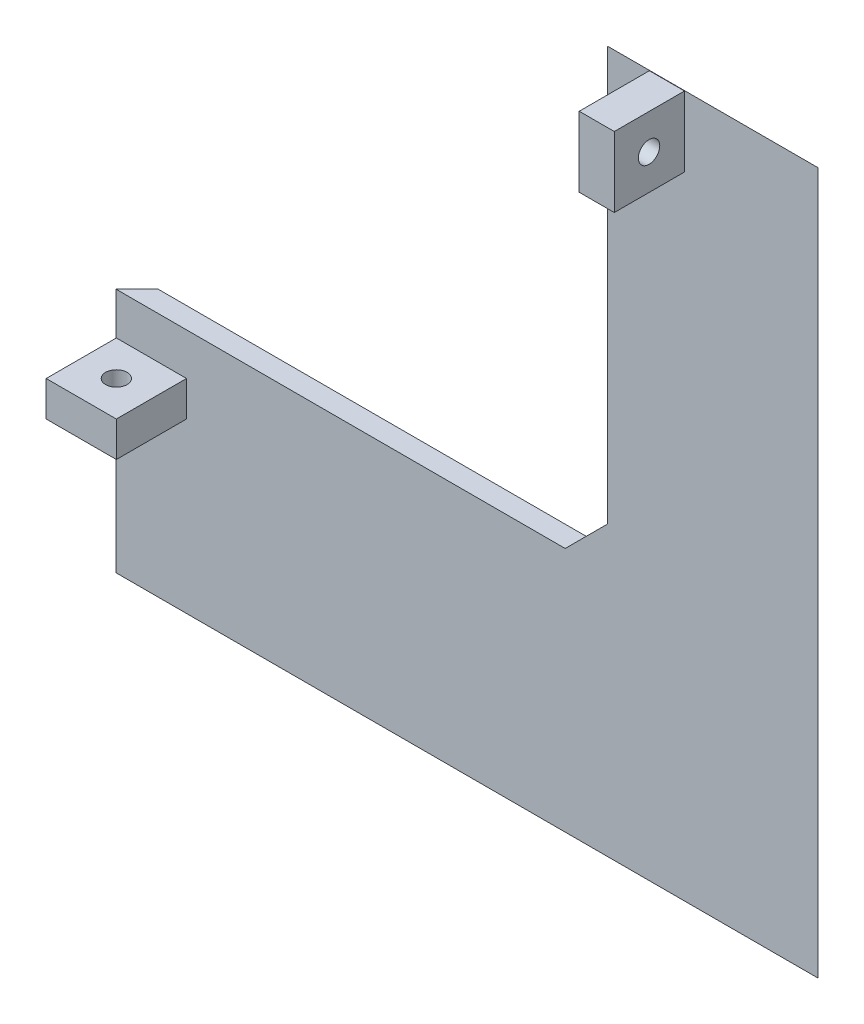
ISO-10303-21;
HEADER;
FILE_DESCRIPTION(('STEP AP214'),'2;1');
FILE_NAME('part.step','',(''),(''),'','','');
FILE_SCHEMA(('AUTOMOTIVE_DESIGN { 1 0 10303 214 1 1 1 1 }'));
ENDSEC;
DATA;
#1=APPLICATION_CONTEXT('core data for automotive mechanical design processes');
#2=APPLICATION_PROTOCOL_DEFINITION('international standard','automotive_design',2000,#1);
#3=PRODUCT_CONTEXT('',#1,'mechanical');
#4=PRODUCT('Part','Part','',(#3));
#5=PRODUCT_RELATED_PRODUCT_CATEGORY('part','',(#4));
#6=PRODUCT_DEFINITION_FORMATION('','',#4);
#7=PRODUCT_DEFINITION_CONTEXT('part definition',#1,'design');
#8=PRODUCT_DEFINITION('design','',#6,#7);
#9=PRODUCT_DEFINITION_SHAPE('','',#8);
#10=(LENGTH_UNIT() NAMED_UNIT(*) SI_UNIT(.MILLI.,.METRE.));
#11=(NAMED_UNIT(*) PLANE_ANGLE_UNIT() SI_UNIT($,.RADIAN.));
#12=(NAMED_UNIT(*) SI_UNIT($,.STERADIAN.) SOLID_ANGLE_UNIT());
#13=UNCERTAINTY_MEASURE_WITH_UNIT(LENGTH_MEASURE(1.E-05),#10,'distance_accuracy_value','');
#14=(GEOMETRIC_REPRESENTATION_CONTEXT(3) GLOBAL_UNCERTAINTY_ASSIGNED_CONTEXT((#13)) GLOBAL_UNIT_ASSIGNED_CONTEXT((#10,
#11,#12)) REPRESENTATION_CONTEXT('',''));
#15=CARTESIAN_POINT('',(0.,0.,0.));
#16=DIRECTION('',(0.,0.,1.));
#17=DIRECTION('',(1.,0.,0.));
#18=AXIS2_PLACEMENT_3D('',#15,#16,#17);
#19=CARTESIAN_POINT('',(0.,0.,3.));
#20=DIRECTION('',(0.,0.,1.));
#21=DIRECTION('',(1.,0.,0.));
#22=AXIS2_PLACEMENT_3D('',#19,#20,#21);
#23=PLANE('',#22);
#24=DIRECTION('',(0.,1.,0.));
#25=VECTOR('',#24,1.);
#26=CARTESIAN_POINT('',(70.,35.,3.));
#27=LINE('',#26,#25);
#28=CARTESIAN_POINT('',(70.,41.,3.));
#29=VERTEX_POINT('',#28);
#30=CARTESIAN_POINT('',(70.,100.,3.));
#31=VERTEX_POINT('',#30);
#32=EDGE_CURVE('E152',#29,#31,#27,.T.);
#33=ORIENTED_EDGE('',*,*,#32,.F.);
#34=DIRECTION('',(0.707106781186545,0.70710678118655,0.));
#35=VECTOR('',#34,1.);
#36=CARTESIAN_POINT('',(70.,41.,3.));
#37=LINE('',#36,#35);
#38=CARTESIAN_POINT('',(64.,35.,3.));
#39=VERTEX_POINT('',#38);
#40=EDGE_CURVE('E41',#29,#39,#37,.F.);
#41=ORIENTED_EDGE('',*,*,#40,.T.);
#42=DIRECTION('',(1.,0.,0.));
#43=VECTOR('',#42,1.);
#44=CARTESIAN_POINT('',(0.,35.,3.));
#45=LINE('',#44,#43);
#46=CARTESIAN_POINT('',(0.,35.,3.));
#47=VERTEX_POINT('',#46);
#48=EDGE_CURVE('E139',#47,#39,#45,.T.);
#49=ORIENTED_EDGE('',*,*,#48,.F.);
#50=DIRECTION('',(0.,-1.,0.));
#51=VECTOR('',#50,1.);
#52=CARTESIAN_POINT('',(0.,100.,3.));
#53=LINE('',#52,#51);
#54=CARTESIAN_POINT('',(0.,0.,3.));
#55=VERTEX_POINT('',#54);
#56=EDGE_CURVE('E150',#47,#55,#53,.T.);
#57=ORIENTED_EDGE('',*,*,#56,.T.);
#58=DIRECTION('',(1.,0.,0.));
#59=VECTOR('',#58,1.);
#60=CARTESIAN_POINT('',(0.,0.,3.));
#61=LINE('',#60,#59);
#62=CARTESIAN_POINT('',(100.,0.,3.));
#63=VERTEX_POINT('',#62);
#64=EDGE_CURVE('E157',#55,#63,#61,.T.);
#65=ORIENTED_EDGE('',*,*,#64,.T.);
#66=DIRECTION('',(0.,1.,0.));
#67=VECTOR('',#66,1.);
#68=CARTESIAN_POINT('',(100.,100.,3.));
#69=LINE('',#68,#67);
#70=CARTESIAN_POINT('',(100.,100.,3.));
#71=VERTEX_POINT('',#70);
#72=EDGE_CURVE('E160',#63,#71,#69,.T.);
#73=ORIENTED_EDGE('',*,*,#72,.T.);
#74=DIRECTION('',(-1.,0.,0.));
#75=VECTOR('',#74,1.);
#76=CARTESIAN_POINT('',(0.,100.,3.));
#77=LINE('',#76,#75);
#78=EDGE_CURVE('E169',#71,#31,#77,.T.);
#79=ORIENTED_EDGE('',*,*,#78,.T.);
#80=EDGE_LOOP('',(#33,#41,#49,#57,#65,#73,#79));
#81=FACE_BOUND('',#80,.T.);
#82=DIRECTION('',(-1.,0.,0.));
#83=VECTOR('',#82,1.);
#84=CARTESIAN_POINT('',(81.,99.95,3.));
#85=LINE('',#84,#83);
#86=CARTESIAN_POINT('',(81.,99.95,3.));
#87=VERTEX_POINT('',#86);
#88=CARTESIAN_POINT('',(76.,99.95,3.));
#89=VERTEX_POINT('',#88);
#90=EDGE_CURVE('E256',#87,#89,#85,.T.);
#91=ORIENTED_EDGE('',*,*,#90,.F.);
#92=DIRECTION('',(0.,1.,0.));
#93=VECTOR('',#92,1.);
#94=CARTESIAN_POINT('',(81.,99.95,3.));
#95=LINE('',#94,#93);
#96=CARTESIAN_POINT('',(81.,89.95,3.));
#97=VERTEX_POINT('',#96);
#98=EDGE_CURVE('E242',#97,#87,#95,.T.);
#99=ORIENTED_EDGE('',*,*,#98,.F.);
#100=DIRECTION('',(1.,0.,0.));
#101=VECTOR('',#100,1.);
#102=CARTESIAN_POINT('',(81.,89.95,3.));
#103=LINE('',#102,#101);
#104=CARTESIAN_POINT('',(76.,89.95,3.));
#105=VERTEX_POINT('',#104);
#106=EDGE_CURVE('E247',#105,#97,#103,.T.);
#107=ORIENTED_EDGE('',*,*,#106,.F.);
#108=DIRECTION('',(0.,-1.,0.));
#109=VECTOR('',#108,1.);
#110=CARTESIAN_POINT('',(76.,99.95,3.));
#111=LINE('',#110,#109);
#112=EDGE_CURVE('E258',#89,#105,#111,.T.);
#113=ORIENTED_EDGE('',*,*,#112,.F.);
#114=EDGE_LOOP('',(#91,#99,#107,#113));
#115=FACE_BOUND('',#114,.T.);
#116=DIRECTION('',(-1.,0.,0.));
#117=VECTOR('',#116,1.);
#118=CARTESIAN_POINT('',(10.05,29.,3.));
#119=LINE('',#118,#117);
#120=CARTESIAN_POINT('',(10.05,29.,3.));
#121=VERTEX_POINT('',#120);
#122=CARTESIAN_POINT('',(0.0499999999999789,29.,3.));
#123=VERTEX_POINT('',#122);
#124=EDGE_CURVE('E227',#121,#123,#119,.T.);
#125=ORIENTED_EDGE('',*,*,#124,.F.);
#126=DIRECTION('',(0.,1.,0.));
#127=VECTOR('',#126,1.);
#128=CARTESIAN_POINT('',(10.05,24.,3.));
#129=LINE('',#128,#127);
#130=CARTESIAN_POINT('',(10.05,24.,3.));
#131=VERTEX_POINT('',#130);
#132=EDGE_CURVE('E186',#131,#121,#129,.T.);
#133=ORIENTED_EDGE('',*,*,#132,.F.);
#134=DIRECTION('',(1.,0.,0.));
#135=VECTOR('',#134,1.);
#136=CARTESIAN_POINT('',(10.05,24.,3.));
#137=LINE('',#136,#135);
#138=CARTESIAN_POINT('',(0.0499999999999876,24.,3.));
#139=VERTEX_POINT('',#138);
#140=EDGE_CURVE('E218',#139,#131,#137,.T.);
#141=ORIENTED_EDGE('',*,*,#140,.F.);
#142=DIRECTION('',(0.,-1.,0.));
#143=VECTOR('',#142,1.);
#144=CARTESIAN_POINT('',(0.0499999999999876,24.,3.));
#145=LINE('',#144,#143);
#146=EDGE_CURVE('E229',#123,#139,#145,.T.);
#147=ORIENTED_EDGE('',*,*,#146,.F.);
#148=EDGE_LOOP('',(#125,#133,#141,#147));
#149=FACE_BOUND('',#148,.T.);
#150=ADVANCED_FACE('F33',(#81,#115,#149),#23,.T.);
#151=CARTESIAN_POINT('',(0.,0.,0.));
#152=DIRECTION('',(0.,0.,1.));
#153=DIRECTION('',(1.,0.,0.));
#154=AXIS2_PLACEMENT_3D('',#151,#152,#153);
#155=PLANE('',#154);
#156=DIRECTION('',(1.,0.,0.));
#157=VECTOR('',#156,1.);
#158=CARTESIAN_POINT('',(0.,35.,0.));
#159=LINE('',#158,#157);
#160=CARTESIAN_POINT('',(3.00000000000001,35.,0.));
#161=VERTEX_POINT('',#160);
#162=CARTESIAN_POINT('',(64.,35.,0.));
#163=VERTEX_POINT('',#162);
#164=EDGE_CURVE('E140',#161,#163,#159,.T.);
#165=ORIENTED_EDGE('',*,*,#164,.T.);
#166=DIRECTION('',(-0.707106781186545,-0.70710678118655,0.));
#167=VECTOR('',#166,1.);
#168=CARTESIAN_POINT('',(14.5000000000002,-14.5000000000001,0.));
#169=LINE('',#168,#167);
#170=CARTESIAN_POINT('',(70.,41.,0.));
#171=VERTEX_POINT('',#170);
#172=EDGE_CURVE('E11',#163,#171,#169,.F.);
#173=ORIENTED_EDGE('',*,*,#172,.T.);
#174=DIRECTION('',(0.,1.,0.));
#175=VECTOR('',#174,1.);
#176=CARTESIAN_POINT('',(70.,0.,0.));
#177=LINE('',#176,#175);
#178=CARTESIAN_POINT('',(70.,97.,0.));
#179=VERTEX_POINT('',#178);
#180=EDGE_CURVE('E202',#171,#179,#177,.T.);
#181=ORIENTED_EDGE('',*,*,#180,.T.);
#182=DIRECTION('',(1.,0.,0.));
#183=VECTOR('',#182,1.);
#184=CARTESIAN_POINT('',(0.,97.,0.));
#185=LINE('',#184,#183);
#186=CARTESIAN_POINT('',(97.,97.,0.));
#187=VERTEX_POINT('',#186);
#188=EDGE_CURVE('E174',#179,#187,#185,.T.);
#189=ORIENTED_EDGE('',*,*,#188,.T.);
#190=DIRECTION('',(0.,-1.,0.));
#191=VECTOR('',#190,1.);
#192=CARTESIAN_POINT('',(97.,0.,0.));
#193=LINE('',#192,#191);
#194=CARTESIAN_POINT('',(97.,3.00000000000002,0.));
#195=VERTEX_POINT('',#194);
#196=EDGE_CURVE('E176',#187,#195,#193,.T.);
#197=ORIENTED_EDGE('',*,*,#196,.T.);
#198=DIRECTION('',(-1.,0.,0.));
#199=VECTOR('',#198,1.);
#200=CARTESIAN_POINT('',(0.,3.00000000000002,0.));
#201=LINE('',#200,#199);
#202=CARTESIAN_POINT('',(3.00000000000002,3.00000000000002,0.));
#203=VERTEX_POINT('',#202);
#204=EDGE_CURVE('E146',#195,#203,#201,.T.);
#205=ORIENTED_EDGE('',*,*,#204,.T.);
#206=DIRECTION('',(0.,1.,0.));
#207=VECTOR('',#206,1.);
#208=CARTESIAN_POINT('',(3.00000000000002,0.,0.));
#209=LINE('',#208,#207);
#210=EDGE_CURVE('E172',#203,#161,#209,.T.);
#211=ORIENTED_EDGE('',*,*,#210,.T.);
#212=EDGE_LOOP('',(#165,#173,#181,#189,#197,#205,#211));
#213=FACE_BOUND('',#212,.T.);
#214=ADVANCED_FACE('F301',(#213),#155,.F.);
#215=CARTESIAN_POINT('',(0.,100.,3.00000000000002));
#216=DIRECTION('',(0.,-0.707106781186548,0.707106781186548));
#217=DIRECTION('',(-1.,0.,0.));
#218=AXIS2_PLACEMENT_3D('',#215,#216,#217);
#219=PLANE('',#218);
#220=DIRECTION('',(0.,0.707106781186548,0.707106781186548));
#221=VECTOR('',#220,1.);
#222=CARTESIAN_POINT('',(70.,100.,3.00000000000002));
#223=LINE('',#222,#221);
#224=EDGE_CURVE('E145',#31,#179,#223,.F.);
#225=ORIENTED_EDGE('',*,*,#224,.F.);
#226=ORIENTED_EDGE('',*,*,#78,.F.);
#227=DIRECTION('',(-0.577350269189626,-0.577350269189626,-0.577350269189626));
#228=VECTOR('',#227,1.);
#229=CARTESIAN_POINT('',(66.6666666666667,66.6666666666667,-30.3333333333333));
#230=LINE('',#229,#228);
#231=EDGE_CURVE('E158',#187,#71,#230,.F.);
#232=ORIENTED_EDGE('',*,*,#231,.F.);
#233=ORIENTED_EDGE('',*,*,#188,.F.);
#234=EDGE_LOOP('',(#225,#226,#232,#233));
#235=FACE_BOUND('',#234,.T.);
#236=ADVANCED_FACE('F307',(#235),#219,.F.);
#237=CARTESIAN_POINT('',(0.,100.,3.00000000000002));
#238=DIRECTION('',(0.707106781186548,0.,0.707106781186548));
#239=DIRECTION('',(0.,-1.,0.));
#240=AXIS2_PLACEMENT_3D('',#237,#238,#239);
#241=PLANE('',#240);
#242=DIRECTION('',(0.707106781186548,0.,-0.707106781186548));
#243=VECTOR('',#242,1.);
#244=CARTESIAN_POINT('',(0.,35.,3.00000000000002));
#245=LINE('',#244,#243);
#246=EDGE_CURVE('E137',#161,#47,#245,.F.);
#247=ORIENTED_EDGE('',*,*,#246,.F.);
#248=ORIENTED_EDGE('',*,*,#210,.F.);
#249=DIRECTION('',(-0.577350269189626,-0.577350269189626,0.577350269189626));
#250=VECTOR('',#249,1.);
#251=CARTESIAN_POINT('',(33.3333333333333,33.3333333333333,-30.3333333333333));
#252=LINE('',#251,#250);
#253=EDGE_CURVE('E155',#55,#203,#252,.F.);
#254=ORIENTED_EDGE('',*,*,#253,.F.);
#255=ORIENTED_EDGE('',*,*,#56,.F.);
#256=EDGE_LOOP('',(#247,#248,#254,#255));
#257=FACE_BOUND('',#256,.T.);
#258=ADVANCED_FACE('F154',(#257),#241,.F.);
#259=CARTESIAN_POINT('',(100.,100.,3.00000000000002));
#260=DIRECTION('',(-0.707106781186548,0.,0.707106781186548));
#261=DIRECTION('',(0.,1.,0.));
#262=AXIS2_PLACEMENT_3D('',#259,#260,#261);
#263=PLANE('',#262);
#264=ORIENTED_EDGE('',*,*,#231,.T.);
#265=ORIENTED_EDGE('',*,*,#72,.F.);
#266=DIRECTION('',(-0.577350269189626,0.577350269189626,-0.577350269189626));
#267=VECTOR('',#266,1.);
#268=CARTESIAN_POINT('',(66.6666666666667,33.3333333333333,-30.3333333333333));
#269=LINE('',#268,#267);
#270=EDGE_CURVE('E180',#195,#63,#269,.F.);
#271=ORIENTED_EDGE('',*,*,#270,.F.);
#272=ORIENTED_EDGE('',*,*,#196,.F.);
#273=EDGE_LOOP('',(#264,#265,#271,#272));
#274=FACE_BOUND('',#273,.T.);
#275=ADVANCED_FACE('F316',(#274),#263,.F.);
#276=CARTESIAN_POINT('',(0.,0.,3.00000000000002));
#277=DIRECTION('',(0.,0.707106781186548,0.707106781186548));
#278=DIRECTION('',(1.,0.,0.));
#279=AXIS2_PLACEMENT_3D('',#276,#277,#278);
#280=PLANE('',#279);
#281=ORIENTED_EDGE('',*,*,#253,.T.);
#282=ORIENTED_EDGE('',*,*,#204,.F.);
#283=ORIENTED_EDGE('',*,*,#270,.T.);
#284=ORIENTED_EDGE('',*,*,#64,.F.);
#285=EDGE_LOOP('',(#281,#282,#283,#284));
#286=FACE_BOUND('',#285,.T.);
#287=ADVANCED_FACE('F313',(#286),#280,.F.);
#288=CARTESIAN_POINT('',(81.,99.95,13.));
#289=DIRECTION('',(-1.,0.,0.));
#290=DIRECTION('',(0.,0.,1.));
#291=AXIS2_PLACEMENT_3D('',#288,#289,#290);
#292=PLANE('',#291);
#293=CARTESIAN_POINT('',(81.,94.95,8.05));
#294=DIRECTION('',(1.,0.,0.));
#295=DIRECTION('',(0.,0.,-1.));
#296=AXIS2_PLACEMENT_3D('',#293,#294,#295);
#297=CIRCLE('',#296,1.525);
#298=CARTESIAN_POINT('',(81.,94.95,6.525));
#299=VERTEX_POINT('',#298);
#300=EDGE_CURVE('E187',#299,#299,#297,.T.);
#301=ORIENTED_EDGE('',*,*,#300,.F.);
#302=EDGE_LOOP('',(#301));
#303=FACE_BOUND('',#302,.T.);
#304=ORIENTED_EDGE('',*,*,#98,.T.);
#305=DIRECTION('',(0.,0.,-1.));
#306=VECTOR('',#305,1.);
#307=CARTESIAN_POINT('',(81.,99.95,13.));
#308=LINE('',#307,#306);
#309=CARTESIAN_POINT('',(81.,99.95,13.));
#310=VERTEX_POINT('',#309);
#311=EDGE_CURVE('E165',#310,#87,#308,.T.);
#312=ORIENTED_EDGE('',*,*,#311,.F.);
#313=DIRECTION('',(0.,1.,0.));
#314=VECTOR('',#313,1.);
#315=CARTESIAN_POINT('',(81.,99.95,13.));
#316=LINE('',#315,#314);
#317=CARTESIAN_POINT('',(81.,89.95,13.));
#318=VERTEX_POINT('',#317);
#319=EDGE_CURVE('E243',#318,#310,#316,.T.);
#320=ORIENTED_EDGE('',*,*,#319,.F.);
#321=DIRECTION('',(0.,0.,-1.));
#322=VECTOR('',#321,1.);
#323=CARTESIAN_POINT('',(81.,89.95,13.));
#324=LINE('',#323,#322);
#325=EDGE_CURVE('E253',#318,#97,#324,.T.);
#326=ORIENTED_EDGE('',*,*,#325,.T.);
#327=EDGE_LOOP('',(#304,#312,#320,#326));
#328=FACE_BOUND('',#327,.T.);
#329=ADVANCED_FACE('F278',(#303,#328),#292,.F.);
#330=CARTESIAN_POINT('',(81.,99.95,13.));
#331=DIRECTION('',(0.,-1.,0.));
#332=DIRECTION('',(0.,0.,-1.));
#333=AXIS2_PLACEMENT_3D('',#330,#331,#332);
#334=PLANE('',#333);
#335=ORIENTED_EDGE('',*,*,#90,.T.);
#336=DIRECTION('',(0.,0.,-1.));
#337=VECTOR('',#336,1.);
#338=CARTESIAN_POINT('',(76.,99.95,13.));
#339=LINE('',#338,#337);
#340=CARTESIAN_POINT('',(76.,99.95,13.));
#341=VERTEX_POINT('',#340);
#342=EDGE_CURVE('E265',#341,#89,#339,.T.);
#343=ORIENTED_EDGE('',*,*,#342,.F.);
#344=DIRECTION('',(-1.,0.,0.));
#345=VECTOR('',#344,1.);
#346=CARTESIAN_POINT('',(81.,99.95,13.));
#347=LINE('',#346,#345);
#348=EDGE_CURVE('E246',#310,#341,#347,.T.);
#349=ORIENTED_EDGE('',*,*,#348,.F.);
#350=ORIENTED_EDGE('',*,*,#311,.T.);
#351=EDGE_LOOP('',(#335,#343,#349,#350));
#352=FACE_BOUND('',#351,.T.);
#353=ADVANCED_FACE('F273',(#352),#334,.F.);
#354=CARTESIAN_POINT('',(76.,99.95,13.));
#355=DIRECTION('',(1.,0.,0.));
#356=DIRECTION('',(0.,0.,-1.));
#357=AXIS2_PLACEMENT_3D('',#354,#355,#356);
#358=PLANE('',#357);
#359=CARTESIAN_POINT('',(76.,94.95,8.05));
#360=DIRECTION('',(1.,0.,0.));
#361=DIRECTION('',(0.,0.,-1.));
#362=AXIS2_PLACEMENT_3D('',#359,#360,#361);
#363=CIRCLE('',#362,1.525);
#364=CARTESIAN_POINT('',(76.,94.95,6.525));
#365=VERTEX_POINT('',#364);
#366=EDGE_CURVE('E183',#365,#365,#363,.T.);
#367=ORIENTED_EDGE('',*,*,#366,.T.);
#368=EDGE_LOOP('',(#367));
#369=FACE_BOUND('',#368,.T.);
#370=ORIENTED_EDGE('',*,*,#112,.T.);
#371=DIRECTION('',(0.,0.,-1.));
#372=VECTOR('',#371,1.);
#373=CARTESIAN_POINT('',(76.,89.95,13.));
#374=LINE('',#373,#372);
#375=CARTESIAN_POINT('',(76.,89.95,13.));
#376=VERTEX_POINT('',#375);
#377=EDGE_CURVE('E264',#376,#105,#374,.T.);
#378=ORIENTED_EDGE('',*,*,#377,.F.);
#379=DIRECTION('',(0.,-1.,0.));
#380=VECTOR('',#379,1.);
#381=CARTESIAN_POINT('',(76.,99.95,13.));
#382=LINE('',#381,#380);
#383=EDGE_CURVE('E249',#341,#376,#382,.T.);
#384=ORIENTED_EDGE('',*,*,#383,.F.);
#385=ORIENTED_EDGE('',*,*,#342,.T.);
#386=EDGE_LOOP('',(#370,#378,#384,#385));
#387=FACE_BOUND('',#386,.T.);
#388=ADVANCED_FACE('F283',(#369,#387),#358,.F.);
#389=CARTESIAN_POINT('',(81.,89.95,13.));
#390=DIRECTION('',(0.,1.,0.));
#391=DIRECTION('',(0.,0.,1.));
#392=AXIS2_PLACEMENT_3D('',#389,#390,#391);
#393=PLANE('',#392);
#394=ORIENTED_EDGE('',*,*,#106,.T.);
#395=ORIENTED_EDGE('',*,*,#325,.F.);
#396=DIRECTION('',(1.,0.,0.));
#397=VECTOR('',#396,1.);
#398=CARTESIAN_POINT('',(81.,89.95,13.));
#399=LINE('',#398,#397);
#400=EDGE_CURVE('E251',#376,#318,#399,.T.);
#401=ORIENTED_EDGE('',*,*,#400,.F.);
#402=ORIENTED_EDGE('',*,*,#377,.T.);
#403=EDGE_LOOP('',(#394,#395,#401,#402));
#404=FACE_BOUND('',#403,.T.);
#405=ADVANCED_FACE('F286',(#404),#393,.F.);
#406=CARTESIAN_POINT('',(0.,0.,13.));
#407=DIRECTION('',(0.,0.,-1.));
#408=DIRECTION('',(-1.,0.,0.));
#409=AXIS2_PLACEMENT_3D('',#406,#407,#408);
#410=PLANE('',#409);
#411=ORIENTED_EDGE('',*,*,#319,.T.);
#412=ORIENTED_EDGE('',*,*,#348,.T.);
#413=ORIENTED_EDGE('',*,*,#383,.T.);
#414=ORIENTED_EDGE('',*,*,#400,.T.);
#415=EDGE_LOOP('',(#411,#412,#413,#414));
#416=FACE_BOUND('',#415,.T.);
#417=ADVANCED_FACE('F288',(#416),#410,.F.);
#418=CARTESIAN_POINT('',(10.05,24.,13.));
#419=DIRECTION('',(-1.,0.,0.));
#420=DIRECTION('',(0.,0.,1.));
#421=AXIS2_PLACEMENT_3D('',#418,#419,#420);
#422=PLANE('',#421);
#423=ORIENTED_EDGE('',*,*,#132,.T.);
#424=DIRECTION('',(0.,0.,-1.));
#425=VECTOR('',#424,1.);
#426=CARTESIAN_POINT('',(10.05,29.,13.));
#427=LINE('',#426,#425);
#428=CARTESIAN_POINT('',(10.05,29.,13.));
#429=VERTEX_POINT('',#428);
#430=EDGE_CURVE('E240',#429,#121,#427,.T.);
#431=ORIENTED_EDGE('',*,*,#430,.F.);
#432=DIRECTION('',(0.,1.,0.));
#433=VECTOR('',#432,1.);
#434=CARTESIAN_POINT('',(10.05,24.,13.));
#435=LINE('',#434,#433);
#436=CARTESIAN_POINT('',(10.05,24.,13.));
#437=VERTEX_POINT('',#436);
#438=EDGE_CURVE('E214',#437,#429,#435,.T.);
#439=ORIENTED_EDGE('',*,*,#438,.F.);
#440=DIRECTION('',(0.,0.,-1.));
#441=VECTOR('',#440,1.);
#442=CARTESIAN_POINT('',(10.05,24.,13.));
#443=LINE('',#442,#441);
#444=EDGE_CURVE('E224',#437,#131,#443,.T.);
#445=ORIENTED_EDGE('',*,*,#444,.T.);
#446=EDGE_LOOP('',(#423,#431,#439,#445));
#447=FACE_BOUND('',#446,.T.);
#448=ADVANCED_FACE('F290',(#447),#422,.F.);
#449=CARTESIAN_POINT('',(10.05,29.,13.));
#450=DIRECTION('',(0.,-1.,0.));
#451=DIRECTION('',(0.,0.,-1.));
#452=AXIS2_PLACEMENT_3D('',#449,#450,#451);
#453=PLANE('',#452);
#454=CARTESIAN_POINT('',(5.04999999999998,29.,8.));
#455=DIRECTION('',(0.,1.,0.));
#456=DIRECTION('',(0.,0.,1.));
#457=AXIS2_PLACEMENT_3D('',#454,#455,#456);
#458=CIRCLE('',#457,1.525);
#459=CARTESIAN_POINT('',(5.04999999999998,29.,9.525));
#460=VERTEX_POINT('',#459);
#461=EDGE_CURVE('E190',#460,#460,#458,.T.);
#462=ORIENTED_EDGE('',*,*,#461,.F.);
#463=EDGE_LOOP('',(#462));
#464=FACE_BOUND('',#463,.T.);
#465=ORIENTED_EDGE('',*,*,#124,.T.);
#466=DIRECTION('',(0.,0.,-1.));
#467=VECTOR('',#466,1.);
#468=CARTESIAN_POINT('',(0.0499999999999789,29.,13.));
#469=LINE('',#468,#467);
#470=CARTESIAN_POINT('',(0.0499999999999789,29.,13.));
#471=VERTEX_POINT('',#470);
#472=EDGE_CURVE('E237',#471,#123,#469,.T.);
#473=ORIENTED_EDGE('',*,*,#472,.F.);
#474=DIRECTION('',(-1.,0.,0.));
#475=VECTOR('',#474,1.);
#476=CARTESIAN_POINT('',(10.05,29.,13.));
#477=LINE('',#476,#475);
#478=EDGE_CURVE('E217',#429,#471,#477,.T.);
#479=ORIENTED_EDGE('',*,*,#478,.F.);
#480=ORIENTED_EDGE('',*,*,#430,.T.);
#481=EDGE_LOOP('',(#465,#473,#479,#480));
#482=FACE_BOUND('',#481,.T.);
#483=ADVANCED_FACE('F296',(#464,#482),#453,.F.);
#484=CARTESIAN_POINT('',(0.0499999999999876,24.,13.));
#485=DIRECTION('',(1.,0.,0.));
#486=DIRECTION('',(0.,1.,0.));
#487=AXIS2_PLACEMENT_3D('',#484,#485,#486);
#488=PLANE('',#487);
#489=ORIENTED_EDGE('',*,*,#146,.T.);
#490=DIRECTION('',(0.,0.,-1.));
#491=VECTOR('',#490,1.);
#492=CARTESIAN_POINT('',(0.0499999999999876,24.,13.));
#493=LINE('',#492,#491);
#494=CARTESIAN_POINT('',(0.0499999999999876,24.,13.));
#495=VERTEX_POINT('',#494);
#496=EDGE_CURVE('E235',#495,#139,#493,.T.);
#497=ORIENTED_EDGE('',*,*,#496,.F.);
#498=DIRECTION('',(0.,-1.,0.));
#499=VECTOR('',#498,1.);
#500=CARTESIAN_POINT('',(0.0499999999999876,24.,13.));
#501=LINE('',#500,#499);
#502=EDGE_CURVE('E220',#471,#495,#501,.T.);
#503=ORIENTED_EDGE('',*,*,#502,.F.);
#504=ORIENTED_EDGE('',*,*,#472,.T.);
#505=EDGE_LOOP('',(#489,#497,#503,#504));
#506=FACE_BOUND('',#505,.T.);
#507=ADVANCED_FACE('F355',(#506),#488,.F.);
#508=CARTESIAN_POINT('',(10.05,24.,13.));
#509=DIRECTION('',(0.,1.,0.));
#510=DIRECTION('',(0.,0.,1.));
#511=AXIS2_PLACEMENT_3D('',#508,#509,#510);
#512=PLANE('',#511);
#513=CARTESIAN_POINT('',(5.04999999999998,24.,8.));
#514=DIRECTION('',(0.,1.,0.));
#515=DIRECTION('',(0.,0.,1.));
#516=AXIS2_PLACEMENT_3D('',#513,#514,#515);
#517=CIRCLE('',#516,1.525);
#518=CARTESIAN_POINT('',(5.04999999999998,24.,9.525));
#519=VERTEX_POINT('',#518);
#520=EDGE_CURVE('E188',#519,#519,#517,.T.);
#521=ORIENTED_EDGE('',*,*,#520,.T.);
#522=EDGE_LOOP('',(#521));
#523=FACE_BOUND('',#522,.T.);
#524=ORIENTED_EDGE('',*,*,#140,.T.);
#525=ORIENTED_EDGE('',*,*,#444,.F.);
#526=DIRECTION('',(1.,0.,0.));
#527=VECTOR('',#526,1.);
#528=CARTESIAN_POINT('',(10.05,24.,13.));
#529=LINE('',#528,#527);
#530=EDGE_CURVE('E222',#495,#437,#529,.T.);
#531=ORIENTED_EDGE('',*,*,#530,.F.);
#532=ORIENTED_EDGE('',*,*,#496,.T.);
#533=EDGE_LOOP('',(#524,#525,#531,#532));
#534=FACE_BOUND('',#533,.T.);
#535=ADVANCED_FACE('F351',(#523,#534),#512,.F.);
#536=CARTESIAN_POINT('',(0.,0.,13.));
#537=DIRECTION('',(0.,0.,1.));
#538=DIRECTION('',(1.,0.,0.));
#539=AXIS2_PLACEMENT_3D('',#536,#537,#538);
#540=PLANE('',#539);
#541=ORIENTED_EDGE('',*,*,#438,.T.);
#542=ORIENTED_EDGE('',*,*,#478,.T.);
#543=ORIENTED_EDGE('',*,*,#502,.T.);
#544=ORIENTED_EDGE('',*,*,#530,.T.);
#545=EDGE_LOOP('',(#541,#542,#543,#544));
#546=FACE_BOUND('',#545,.T.);
#547=ADVANCED_FACE('F347',(#546),#540,.T.);
#548=CARTESIAN_POINT('',(71.,94.95,8.05));
#549=DIRECTION('',(1.,0.,0.));
#550=DIRECTION('',(0.,0.,-1.));
#551=AXIS2_PLACEMENT_3D('',#548,#549,#550);
#552=CYLINDRICAL_SURFACE('',#551,1.525);
#553=ORIENTED_EDGE('',*,*,#300,.T.);
#554=EDGE_LOOP('',(#553));
#555=FACE_BOUND('',#554,.T.);
#556=ORIENTED_EDGE('',*,*,#366,.F.);
#557=EDGE_LOOP('',(#556));
#558=FACE_BOUND('',#557,.T.);
#559=ADVANCED_FACE('F343',(#555,#558),#552,.F.);
#560=CARTESIAN_POINT('',(5.04999999999998,19.,8.));
#561=DIRECTION('',(0.,1.,0.));
#562=DIRECTION('',(0.,0.,1.));
#563=AXIS2_PLACEMENT_3D('',#560,#561,#562);
#564=CYLINDRICAL_SURFACE('',#563,1.525);
#565=ORIENTED_EDGE('',*,*,#461,.T.);
#566=EDGE_LOOP('',(#565));
#567=FACE_BOUND('',#566,.T.);
#568=ORIENTED_EDGE('',*,*,#520,.F.);
#569=EDGE_LOOP('',(#568));
#570=FACE_BOUND('',#569,.T.);
#571=ADVANCED_FACE('F338',(#567,#570),#564,.F.);
#572=CARTESIAN_POINT('',(70.,35.,-7.));
#573=DIRECTION('',(1.,0.,0.));
#574=DIRECTION('',(0.,0.,-1.));
#575=AXIS2_PLACEMENT_3D('',#572,#573,#574);
#576=PLANE('',#575);
#577=ORIENTED_EDGE('',*,*,#180,.F.);
#578=DIRECTION('',(0.,0.,1.));
#579=VECTOR('',#578,1.);
#580=CARTESIAN_POINT('',(70.,41.,3.));
#581=LINE('',#580,#579);
#582=EDGE_CURVE('E194',#171,#29,#581,.T.);
#583=ORIENTED_EDGE('',*,*,#582,.T.);
#584=ORIENTED_EDGE('',*,*,#32,.T.);
#585=ORIENTED_EDGE('',*,*,#224,.T.);
#586=EDGE_LOOP('',(#577,#583,#584,#585));
#587=FACE_BOUND('',#586,.T.);
#588=ADVANCED_FACE('F200',(#587),#576,.F.);
#589=CARTESIAN_POINT('',(0.,35.,-7.));
#590=DIRECTION('',(0.,-1.,0.));
#591=DIRECTION('',(0.,0.,-1.));
#592=AXIS2_PLACEMENT_3D('',#589,#590,#591);
#593=PLANE('',#592);
#594=ORIENTED_EDGE('',*,*,#48,.T.);
#595=DIRECTION('',(0.,0.,-1.));
#596=VECTOR('',#595,1.);
#597=CARTESIAN_POINT('',(64.,35.,0.));
#598=LINE('',#597,#596);
#599=EDGE_CURVE('E48',#39,#163,#598,.T.);
#600=ORIENTED_EDGE('',*,*,#599,.T.);
#601=ORIENTED_EDGE('',*,*,#164,.F.);
#602=ORIENTED_EDGE('',*,*,#246,.T.);
#603=EDGE_LOOP('',(#594,#600,#601,#602));
#604=FACE_BOUND('',#603,.T.);
#605=ADVANCED_FACE('F138',(#604),#593,.F.);
#606=CARTESIAN_POINT('',(70.,41.,-7.));
#607=DIRECTION('',(-0.70710678118655,0.707106781186545,0.));
#608=DIRECTION('',(0.,0.,-1.));
#609=AXIS2_PLACEMENT_3D('',#606,#607,#608);
#610=PLANE('',#609);
#611=ORIENTED_EDGE('',*,*,#172,.F.);
#612=ORIENTED_EDGE('',*,*,#599,.F.);
#613=ORIENTED_EDGE('',*,*,#40,.F.);
#614=ORIENTED_EDGE('',*,*,#582,.F.);
#615=EDGE_LOOP('',(#611,#612,#613,#614));
#616=FACE_BOUND('',#615,.T.);
#617=ADVANCED_FACE('F35',(#616),#610,.T.);
#618=CLOSED_SHELL('',(#150,#214,#236,#258,#275,#287,#329,#353,#388,#405,#417,#448,#483,#507,
#535,#547,#559,#571,#588,#605,#617));
#619=MANIFOLD_SOLID_BREP('B2',#618);
#620=ADVANCED_BREP_SHAPE_REPRESENTATION('',(#18,#619),#14);
#621=SHAPE_DEFINITION_REPRESENTATION(#9,#620);
ENDSEC;
END-ISO-10303-21;
